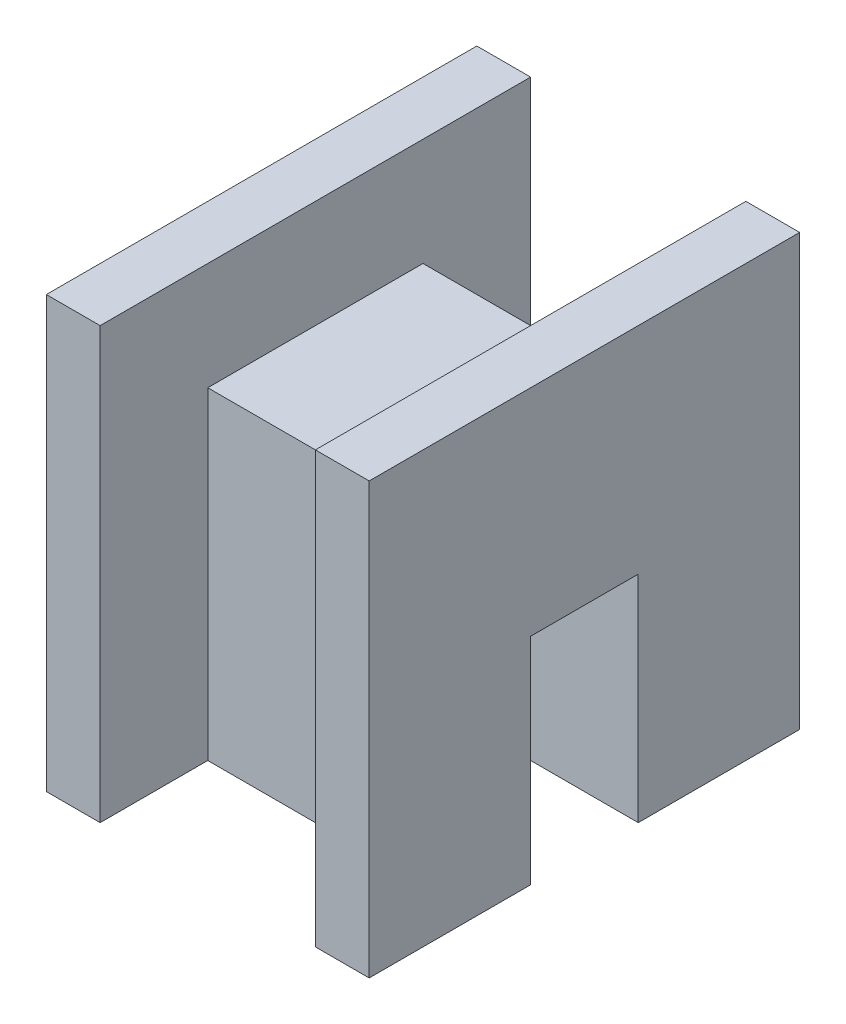
ISO-10303-21;
HEADER;
FILE_DESCRIPTION(('STEP AP214'),'2;1');
FILE_NAME('part.step','',(''),(''),'','','');
FILE_SCHEMA(('AUTOMOTIVE_DESIGN { 1 0 10303 214 1 1 1 1 }'));
ENDSEC;
DATA;
#1=APPLICATION_CONTEXT('core data for automotive mechanical design processes');
#2=APPLICATION_PROTOCOL_DEFINITION('international standard','automotive_design',2000,#1);
#3=PRODUCT_CONTEXT('',#1,'mechanical');
#4=PRODUCT('Part','Part','',(#3));
#5=PRODUCT_RELATED_PRODUCT_CATEGORY('part','',(#4));
#6=PRODUCT_DEFINITION_FORMATION('','',#4);
#7=PRODUCT_DEFINITION_CONTEXT('part definition',#1,'design');
#8=PRODUCT_DEFINITION('design','',#6,#7);
#9=PRODUCT_DEFINITION_SHAPE('','',#8);
#10=(LENGTH_UNIT() NAMED_UNIT(*) SI_UNIT(.MILLI.,.METRE.));
#11=(NAMED_UNIT(*) PLANE_ANGLE_UNIT() SI_UNIT($,.RADIAN.));
#12=(NAMED_UNIT(*) SI_UNIT($,.STERADIAN.) SOLID_ANGLE_UNIT());
#13=UNCERTAINTY_MEASURE_WITH_UNIT(LENGTH_MEASURE(1.E-05),#10,'distance_accuracy_value','');
#14=(GEOMETRIC_REPRESENTATION_CONTEXT(3) GLOBAL_UNCERTAINTY_ASSIGNED_CONTEXT((#13)) GLOBAL_UNIT_ASSIGNED_CONTEXT((#10,
#11,#12)) REPRESENTATION_CONTEXT('',''));
#15=CARTESIAN_POINT('',(0.,0.,0.));
#16=DIRECTION('',(0.,0.,1.));
#17=DIRECTION('',(1.,0.,0.));
#18=AXIS2_PLACEMENT_3D('',#15,#16,#17);
#19=CARTESIAN_POINT('',(15.,40.,-20.));
#20=DIRECTION('',(0.,0.,1.));
#21=DIRECTION('',(0.,-1.,0.));
#22=AXIS2_PLACEMENT_3D('',#19,#20,#21);
#23=PLANE('',#22);
#24=DIRECTION('',(0.,1.,0.));
#25=VECTOR('',#24,1.);
#26=CARTESIAN_POINT('',(10.,40.,-20.));
#27=LINE('',#26,#25);
#28=CARTESIAN_POINT('',(10.,0.,-20.));
#29=VERTEX_POINT('',#28);
#30=CARTESIAN_POINT('',(10.,40.,-20.));
#31=VERTEX_POINT('',#30);
#32=EDGE_CURVE('E140',#29,#31,#27,.T.);
#33=ORIENTED_EDGE('',*,*,#32,.T.);
#34=DIRECTION('',(-1.,0.,0.));
#35=VECTOR('',#34,1.);
#36=CARTESIAN_POINT('',(15.,40.,-20.));
#37=LINE('',#36,#35);
#38=CARTESIAN_POINT('',(15.,40.,-20.));
#39=VERTEX_POINT('',#38);
#40=EDGE_CURVE('E137',#39,#31,#37,.T.);
#41=ORIENTED_EDGE('',*,*,#40,.F.);
#42=DIRECTION('',(0.,1.,0.));
#43=VECTOR('',#42,1.);
#44=CARTESIAN_POINT('',(15.,40.,-20.));
#45=LINE('',#44,#43);
#46=CARTESIAN_POINT('',(15.,0.,-20.));
#47=VERTEX_POINT('',#46);
#48=EDGE_CURVE('E122',#47,#39,#45,.T.);
#49=ORIENTED_EDGE('',*,*,#48,.F.);
#50=DIRECTION('',(-1.,0.,0.));
#51=VECTOR('',#50,1.);
#52=CARTESIAN_POINT('',(15.,0.,-20.));
#53=LINE('',#52,#51);
#54=EDGE_CURVE('E192',#47,#29,#53,.T.);
#55=ORIENTED_EDGE('',*,*,#54,.T.);
#56=EDGE_LOOP('',(#33,#41,#49,#55));
#57=FACE_BOUND('',#56,.T.);
#58=ADVANCED_FACE('F39',(#57),#23,.F.);
#59=CARTESIAN_POINT('',(15.,40.,20.));
#60=DIRECTION('',(0.,-1.,0.));
#61=DIRECTION('',(0.,0.,-1.));
#62=AXIS2_PLACEMENT_3D('',#59,#60,#61);
#63=PLANE('',#62);
#64=DIRECTION('',(0.,0.,1.));
#65=VECTOR('',#64,1.);
#66=CARTESIAN_POINT('',(10.,40.,20.));
#67=LINE('',#66,#65);
#68=CARTESIAN_POINT('',(10.,40.,20.));
#69=VERTEX_POINT('',#68);
#70=EDGE_CURVE('E255',#31,#69,#67,.T.);
#71=ORIENTED_EDGE('',*,*,#70,.T.);
#72=DIRECTION('',(-1.,0.,0.));
#73=VECTOR('',#72,1.);
#74=CARTESIAN_POINT('',(15.,40.,20.));
#75=LINE('',#74,#73);
#76=CARTESIAN_POINT('',(15.,40.,20.));
#77=VERTEX_POINT('',#76);
#78=EDGE_CURVE('E149',#77,#69,#75,.T.);
#79=ORIENTED_EDGE('',*,*,#78,.F.);
#80=DIRECTION('',(0.,0.,1.));
#81=VECTOR('',#80,1.);
#82=CARTESIAN_POINT('',(15.,40.,20.));
#83=LINE('',#82,#81);
#84=EDGE_CURVE('E126',#39,#77,#83,.T.);
#85=ORIENTED_EDGE('',*,*,#84,.F.);
#86=ORIENTED_EDGE('',*,*,#40,.T.);
#87=EDGE_LOOP('',(#71,#79,#85,#86));
#88=FACE_BOUND('',#87,.T.);
#89=ADVANCED_FACE('F147',(#88),#63,.F.);
#90=CARTESIAN_POINT('',(15.,0.,20.));
#91=DIRECTION('',(0.,0.,-1.));
#92=DIRECTION('',(0.,1.,0.));
#93=AXIS2_PLACEMENT_3D('',#90,#91,#92);
#94=PLANE('',#93);
#95=DIRECTION('',(0.,-1.,0.));
#96=VECTOR('',#95,1.);
#97=CARTESIAN_POINT('',(10.,0.,20.));
#98=LINE('',#97,#96);
#99=CARTESIAN_POINT('',(10.,0.,20.));
#100=VERTEX_POINT('',#99);
#101=EDGE_CURVE('E251',#69,#100,#98,.T.);
#102=ORIENTED_EDGE('',*,*,#101,.T.);
#103=DIRECTION('',(-1.,0.,0.));
#104=VECTOR('',#103,1.);
#105=CARTESIAN_POINT('',(15.,0.,20.));
#106=LINE('',#105,#104);
#107=CARTESIAN_POINT('',(15.,0.,20.));
#108=VERTEX_POINT('',#107);
#109=EDGE_CURVE('E185',#108,#100,#106,.T.);
#110=ORIENTED_EDGE('',*,*,#109,.F.);
#111=DIRECTION('',(0.,-1.,0.));
#112=VECTOR('',#111,1.);
#113=CARTESIAN_POINT('',(15.,0.,20.));
#114=LINE('',#113,#112);
#115=EDGE_CURVE('E64',#77,#108,#114,.T.);
#116=ORIENTED_EDGE('',*,*,#115,.F.);
#117=ORIENTED_EDGE('',*,*,#78,.T.);
#118=EDGE_LOOP('',(#102,#110,#116,#117));
#119=FACE_BOUND('',#118,.T.);
#120=ADVANCED_FACE('F340',(#119),#94,.F.);
#121=CARTESIAN_POINT('',(15.,0.,5.));
#122=DIRECTION('',(0.,1.,0.));
#123=DIRECTION('',(0.,0.,1.));
#124=AXIS2_PLACEMENT_3D('',#121,#122,#123);
#125=PLANE('',#124);
#126=DIRECTION('',(1.,0.,0.));
#127=VECTOR('',#126,1.);
#128=CARTESIAN_POINT('',(-10.,0.,10.));
#129=LINE('',#128,#127);
#130=CARTESIAN_POINT('',(-10.,0.,10.));
#131=VERTEX_POINT('',#130);
#132=CARTESIAN_POINT('',(10.,0.,10.));
#133=VERTEX_POINT('',#132);
#134=EDGE_CURVE('E235',#131,#133,#129,.T.);
#135=ORIENTED_EDGE('',*,*,#134,.F.);
#136=DIRECTION('',(0.,0.,-1.));
#137=VECTOR('',#136,1.);
#138=CARTESIAN_POINT('',(-10.,0.,10.));
#139=LINE('',#138,#137);
#140=CARTESIAN_POINT('',(-10.,0.,20.));
#141=VERTEX_POINT('',#140);
#142=EDGE_CURVE('E254',#141,#131,#139,.T.);
#143=ORIENTED_EDGE('',*,*,#142,.F.);
#144=CARTESIAN_POINT('',(-15.,0.,20.));
#145=VERTEX_POINT('',#144);
#146=EDGE_CURVE('E98',#141,#145,#106,.T.);
#147=ORIENTED_EDGE('',*,*,#146,.T.);
#148=DIRECTION('',(0.,0.,-1.));
#149=VECTOR('',#148,1.);
#150=CARTESIAN_POINT('',(-15.,0.,5.));
#151=LINE('',#150,#149);
#152=CARTESIAN_POINT('',(-15.,0.,5.));
#153=VERTEX_POINT('',#152);
#154=EDGE_CURVE('E156',#145,#153,#151,.T.);
#155=ORIENTED_EDGE('',*,*,#154,.T.);
#156=DIRECTION('',(-1.,0.,0.));
#157=VECTOR('',#156,1.);
#158=CARTESIAN_POINT('',(15.,0.,5.));
#159=LINE('',#158,#157);
#160=CARTESIAN_POINT('',(15.,0.,5.));
#161=VERTEX_POINT('',#160);
#162=EDGE_CURVE('E11',#161,#153,#159,.T.);
#163=ORIENTED_EDGE('',*,*,#162,.F.);
#164=DIRECTION('',(0.,0.,-1.));
#165=VECTOR('',#164,1.);
#166=CARTESIAN_POINT('',(15.,0.,5.));
#167=LINE('',#166,#165);
#168=EDGE_CURVE('E184',#108,#161,#167,.T.);
#169=ORIENTED_EDGE('',*,*,#168,.F.);
#170=ORIENTED_EDGE('',*,*,#109,.T.);
#171=DIRECTION('',(0.,0.,-1.));
#172=VECTOR('',#171,1.);
#173=CARTESIAN_POINT('',(10.,0.,10.));
#174=LINE('',#173,#172);
#175=EDGE_CURVE('E55',#100,#133,#174,.T.);
#176=ORIENTED_EDGE('',*,*,#175,.T.);
#177=EDGE_LOOP('',(#135,#143,#147,#155,#163,#169,#170,#176));
#178=FACE_BOUND('',#177,.T.);
#179=ADVANCED_FACE('F41',(#178),#125,.F.);
#180=CARTESIAN_POINT('',(15.,20.,5.));
#181=DIRECTION('',(0.,0.,1.));
#182=DIRECTION('',(0.,-1.,0.));
#183=AXIS2_PLACEMENT_3D('',#180,#181,#182);
#184=PLANE('',#183);
#185=DIRECTION('',(0.,1.,0.));
#186=VECTOR('',#185,1.);
#187=CARTESIAN_POINT('',(-15.,20.,5.));
#188=LINE('',#187,#186);
#189=CARTESIAN_POINT('',(-15.,20.,5.));
#190=VERTEX_POINT('',#189);
#191=EDGE_CURVE('E159',#153,#190,#188,.T.);
#192=ORIENTED_EDGE('',*,*,#191,.T.);
#193=DIRECTION('',(-1.,0.,0.));
#194=VECTOR('',#193,1.);
#195=CARTESIAN_POINT('',(15.,20.,5.));
#196=LINE('',#195,#194);
#197=CARTESIAN_POINT('',(15.,20.,5.));
#198=VERTEX_POINT('',#197);
#199=EDGE_CURVE('E48',#198,#190,#196,.T.);
#200=ORIENTED_EDGE('',*,*,#199,.F.);
#201=DIRECTION('',(0.,1.,0.));
#202=VECTOR('',#201,1.);
#203=CARTESIAN_POINT('',(15.,20.,5.));
#204=LINE('',#203,#202);
#205=EDGE_CURVE('E106',#161,#198,#204,.T.);
#206=ORIENTED_EDGE('',*,*,#205,.F.);
#207=ORIENTED_EDGE('',*,*,#162,.T.);
#208=EDGE_LOOP('',(#192,#200,#206,#207));
#209=FACE_BOUND('',#208,.T.);
#210=ADVANCED_FACE('F343',(#209),#184,.F.);
#211=CARTESIAN_POINT('',(15.,20.,-5.));
#212=DIRECTION('',(0.,1.,0.));
#213=DIRECTION('',(0.,0.,1.));
#214=AXIS2_PLACEMENT_3D('',#211,#212,#213);
#215=PLANE('',#214);
#216=DIRECTION('',(0.,0.,-1.));
#217=VECTOR('',#216,1.);
#218=CARTESIAN_POINT('',(-15.,20.,-5.));
#219=LINE('',#218,#217);
#220=CARTESIAN_POINT('',(-15.,20.,-5.));
#221=VERTEX_POINT('',#220);
#222=EDGE_CURVE('E163',#190,#221,#219,.T.);
#223=ORIENTED_EDGE('',*,*,#222,.T.);
#224=DIRECTION('',(-1.,0.,0.));
#225=VECTOR('',#224,1.);
#226=CARTESIAN_POINT('',(15.,20.,-5.));
#227=LINE('',#226,#225);
#228=CARTESIAN_POINT('',(15.,20.,-5.));
#229=VERTEX_POINT('',#228);
#230=EDGE_CURVE('E199',#229,#221,#227,.T.);
#231=ORIENTED_EDGE('',*,*,#230,.F.);
#232=DIRECTION('',(0.,0.,-1.));
#233=VECTOR('',#232,1.);
#234=CARTESIAN_POINT('',(15.,20.,-5.));
#235=LINE('',#234,#233);
#236=EDGE_CURVE('E209',#198,#229,#235,.T.);
#237=ORIENTED_EDGE('',*,*,#236,.F.);
#238=ORIENTED_EDGE('',*,*,#199,.T.);
#239=EDGE_LOOP('',(#223,#231,#237,#238));
#240=FACE_BOUND('',#239,.T.);
#241=ADVANCED_FACE('F207',(#240),#215,.F.);
#242=CARTESIAN_POINT('',(15.,0.,-5.));
#243=DIRECTION('',(0.,0.,-1.));
#244=DIRECTION('',(0.,1.,0.));
#245=AXIS2_PLACEMENT_3D('',#242,#243,#244);
#246=PLANE('',#245);
#247=DIRECTION('',(0.,-1.,0.));
#248=VECTOR('',#247,1.);
#249=CARTESIAN_POINT('',(-15.,0.,-5.));
#250=LINE('',#249,#248);
#251=CARTESIAN_POINT('',(-15.,0.,-5.));
#252=VERTEX_POINT('',#251);
#253=EDGE_CURVE('E166',#221,#252,#250,.T.);
#254=ORIENTED_EDGE('',*,*,#253,.T.);
#255=DIRECTION('',(-1.,0.,0.));
#256=VECTOR('',#255,1.);
#257=CARTESIAN_POINT('',(15.,0.,-5.));
#258=LINE('',#257,#256);
#259=CARTESIAN_POINT('',(15.,0.,-5.));
#260=VERTEX_POINT('',#259);
#261=EDGE_CURVE('E195',#260,#252,#258,.T.);
#262=ORIENTED_EDGE('',*,*,#261,.F.);
#263=DIRECTION('',(0.,-1.,0.));
#264=VECTOR('',#263,1.);
#265=CARTESIAN_POINT('',(15.,0.,-5.));
#266=LINE('',#265,#264);
#267=EDGE_CURVE('E225',#229,#260,#266,.T.);
#268=ORIENTED_EDGE('',*,*,#267,.F.);
#269=ORIENTED_EDGE('',*,*,#230,.T.);
#270=EDGE_LOOP('',(#254,#262,#268,#269));
#271=FACE_BOUND('',#270,.T.);
#272=ADVANCED_FACE('F218',(#271),#246,.F.);
#273=CARTESIAN_POINT('',(15.,0.,-20.));
#274=DIRECTION('',(0.,1.,0.));
#275=DIRECTION('',(0.,0.,1.));
#276=AXIS2_PLACEMENT_3D('',#273,#274,#275);
#277=PLANE('',#276);
#278=CARTESIAN_POINT('',(-10.,0.,-20.));
#279=VERTEX_POINT('',#278);
#280=CARTESIAN_POINT('',(-15.,0.,-20.));
#281=VERTEX_POINT('',#280);
#282=EDGE_CURVE('E144',#279,#281,#53,.T.);
#283=ORIENTED_EDGE('',*,*,#282,.F.);
#284=DIRECTION('',(0.,0.,-1.));
#285=VECTOR('',#284,1.);
#286=CARTESIAN_POINT('',(-10.,0.,-20.));
#287=LINE('',#286,#285);
#288=CARTESIAN_POINT('',(-10.,0.,-10.));
#289=VERTEX_POINT('',#288);
#290=EDGE_CURVE('E288',#289,#279,#287,.T.);
#291=ORIENTED_EDGE('',*,*,#290,.F.);
#292=DIRECTION('',(1.,0.,0.));
#293=VECTOR('',#292,1.);
#294=CARTESIAN_POINT('',(-10.,0.,-10.));
#295=LINE('',#294,#293);
#296=CARTESIAN_POINT('',(10.,0.,-10.));
#297=VERTEX_POINT('',#296);
#298=EDGE_CURVE('E160',#289,#297,#295,.T.);
#299=ORIENTED_EDGE('',*,*,#298,.T.);
#300=DIRECTION('',(0.,0.,-1.));
#301=VECTOR('',#300,1.);
#302=CARTESIAN_POINT('',(10.,0.,-20.));
#303=LINE('',#302,#301);
#304=EDGE_CURVE('E260',#297,#29,#303,.T.);
#305=ORIENTED_EDGE('',*,*,#304,.T.);
#306=ORIENTED_EDGE('',*,*,#54,.F.);
#307=DIRECTION('',(0.,0.,-1.));
#308=VECTOR('',#307,1.);
#309=CARTESIAN_POINT('',(15.,0.,-20.));
#310=LINE('',#309,#308);
#311=EDGE_CURVE('E129',#260,#47,#310,.T.);
#312=ORIENTED_EDGE('',*,*,#311,.F.);
#313=ORIENTED_EDGE('',*,*,#261,.T.);
#314=DIRECTION('',(0.,0.,-1.));
#315=VECTOR('',#314,1.);
#316=CARTESIAN_POINT('',(-15.,0.,-20.));
#317=LINE('',#316,#315);
#318=EDGE_CURVE('E169',#252,#281,#317,.T.);
#319=ORIENTED_EDGE('',*,*,#318,.T.);
#320=EDGE_LOOP('',(#283,#291,#299,#305,#306,#312,#313,#319));
#321=FACE_BOUND('',#320,.T.);
#322=ADVANCED_FACE('F222',(#321),#277,.F.);
#323=CARTESIAN_POINT('',(-10.,40.,-20.));
#324=VERTEX_POINT('',#323);
#325=CARTESIAN_POINT('',(-15.,40.,-20.));
#326=VERTEX_POINT('',#325);
#327=EDGE_CURVE('E145',#324,#326,#37,.T.);
#328=ORIENTED_EDGE('',*,*,#327,.F.);
#329=DIRECTION('',(0.,1.,0.));
#330=VECTOR('',#329,1.);
#331=CARTESIAN_POINT('',(-10.,40.,-20.));
#332=LINE('',#331,#330);
#333=EDGE_CURVE('E284',#279,#324,#332,.T.);
#334=ORIENTED_EDGE('',*,*,#333,.F.);
#335=ORIENTED_EDGE('',*,*,#282,.T.);
#336=DIRECTION('',(0.,1.,0.));
#337=VECTOR('',#336,1.);
#338=CARTESIAN_POINT('',(-15.,40.,-20.));
#339=LINE('',#338,#337);
#340=EDGE_CURVE('E173',#281,#326,#339,.T.);
#341=ORIENTED_EDGE('',*,*,#340,.T.);
#342=EDGE_LOOP('',(#328,#334,#335,#341));
#343=FACE_BOUND('',#342,.T.);
#344=ADVANCED_FACE('F352',(#343),#23,.F.);
#345=CARTESIAN_POINT('',(-10.,40.,20.));
#346=VERTEX_POINT('',#345);
#347=CARTESIAN_POINT('',(-15.,40.,20.));
#348=VERTEX_POINT('',#347);
#349=EDGE_CURVE('E189',#346,#348,#75,.T.);
#350=ORIENTED_EDGE('',*,*,#349,.F.);
#351=DIRECTION('',(0.,0.,1.));
#352=VECTOR('',#351,1.);
#353=CARTESIAN_POINT('',(-10.,40.,20.));
#354=LINE('',#353,#352);
#355=EDGE_CURVE('E280',#324,#346,#354,.T.);
#356=ORIENTED_EDGE('',*,*,#355,.F.);
#357=ORIENTED_EDGE('',*,*,#327,.T.);
#358=DIRECTION('',(0.,0.,1.));
#359=VECTOR('',#358,1.);
#360=CARTESIAN_POINT('',(-15.,40.,20.));
#361=LINE('',#360,#359);
#362=EDGE_CURVE('E177',#326,#348,#361,.T.);
#363=ORIENTED_EDGE('',*,*,#362,.T.);
#364=EDGE_LOOP('',(#350,#356,#357,#363));
#365=FACE_BOUND('',#364,.T.);
#366=ADVANCED_FACE('F357',(#365),#63,.F.);
#367=ORIENTED_EDGE('',*,*,#146,.F.);
#368=DIRECTION('',(0.,-1.,0.));
#369=VECTOR('',#368,1.);
#370=CARTESIAN_POINT('',(-10.,0.,20.));
#371=LINE('',#370,#369);
#372=EDGE_CURVE('E240',#346,#141,#371,.T.);
#373=ORIENTED_EDGE('',*,*,#372,.F.);
#374=ORIENTED_EDGE('',*,*,#349,.T.);
#375=DIRECTION('',(0.,-1.,0.));
#376=VECTOR('',#375,1.);
#377=CARTESIAN_POINT('',(-15.,0.,20.));
#378=LINE('',#377,#376);
#379=EDGE_CURVE('E181',#348,#145,#378,.T.);
#380=ORIENTED_EDGE('',*,*,#379,.T.);
#381=EDGE_LOOP('',(#367,#373,#374,#380));
#382=FACE_BOUND('',#381,.T.);
#383=ADVANCED_FACE('F365',(#382),#94,.F.);
#384=CARTESIAN_POINT('',(15.,0.,0.));
#385=DIRECTION('',(-1.,0.,0.));
#386=DIRECTION('',(0.,0.,1.));
#387=AXIS2_PLACEMENT_3D('',#384,#385,#386);
#388=PLANE('',#387);
#389=ORIENTED_EDGE('',*,*,#168,.T.);
#390=ORIENTED_EDGE('',*,*,#205,.T.);
#391=ORIENTED_EDGE('',*,*,#236,.T.);
#392=ORIENTED_EDGE('',*,*,#267,.T.);
#393=ORIENTED_EDGE('',*,*,#311,.T.);
#394=ORIENTED_EDGE('',*,*,#48,.T.);
#395=ORIENTED_EDGE('',*,*,#84,.T.);
#396=ORIENTED_EDGE('',*,*,#115,.T.);
#397=EDGE_LOOP('',(#389,#390,#391,#392,#393,#394,#395,#396));
#398=FACE_BOUND('',#397,.T.);
#399=ADVANCED_FACE('F124',(#398),#388,.F.);
#400=CARTESIAN_POINT('',(-15.,0.,0.));
#401=DIRECTION('',(-1.,0.,0.));
#402=DIRECTION('',(0.,0.,1.));
#403=AXIS2_PLACEMENT_3D('',#400,#401,#402);
#404=PLANE('',#403);
#405=ORIENTED_EDGE('',*,*,#154,.F.);
#406=ORIENTED_EDGE('',*,*,#379,.F.);
#407=ORIENTED_EDGE('',*,*,#362,.F.);
#408=ORIENTED_EDGE('',*,*,#340,.F.);
#409=ORIENTED_EDGE('',*,*,#318,.F.);
#410=ORIENTED_EDGE('',*,*,#253,.F.);
#411=ORIENTED_EDGE('',*,*,#222,.F.);
#412=ORIENTED_EDGE('',*,*,#191,.F.);
#413=EDGE_LOOP('',(#405,#406,#407,#408,#409,#410,#411,#412));
#414=FACE_BOUND('',#413,.T.);
#415=ADVANCED_FACE('F213',(#414),#404,.T.);
#416=CARTESIAN_POINT('',(-10.,30.,-10.));
#417=DIRECTION('',(0.,0.,1.));
#418=DIRECTION('',(1.,0.,0.));
#419=AXIS2_PLACEMENT_3D('',#416,#417,#418);
#420=PLANE('',#419);
#421=DIRECTION('',(0.,-1.,0.));
#422=VECTOR('',#421,1.);
#423=CARTESIAN_POINT('',(10.,30.,-10.));
#424=LINE('',#423,#422);
#425=CARTESIAN_POINT('',(10.,30.,-10.));
#426=VERTEX_POINT('',#425);
#427=EDGE_CURVE('E263',#426,#297,#424,.T.);
#428=ORIENTED_EDGE('',*,*,#427,.T.);
#429=ORIENTED_EDGE('',*,*,#298,.F.);
#430=DIRECTION('',(0.,-1.,0.));
#431=VECTOR('',#430,1.);
#432=CARTESIAN_POINT('',(-10.,30.,-10.));
#433=LINE('',#432,#431);
#434=CARTESIAN_POINT('',(-10.,30.,-10.));
#435=VERTEX_POINT('',#434);
#436=EDGE_CURVE('E292',#435,#289,#433,.T.);
#437=ORIENTED_EDGE('',*,*,#436,.F.);
#438=DIRECTION('',(1.,0.,0.));
#439=VECTOR('',#438,1.);
#440=CARTESIAN_POINT('',(-10.,30.,-10.));
#441=LINE('',#440,#439);
#442=EDGE_CURVE('E244',#435,#426,#441,.T.);
#443=ORIENTED_EDGE('',*,*,#442,.T.);
#444=EDGE_LOOP('',(#428,#429,#437,#443));
#445=FACE_BOUND('',#444,.T.);
#446=ADVANCED_FACE('F391',(#445),#420,.F.);
#447=CARTESIAN_POINT('',(-10.,30.,10.));
#448=DIRECTION('',(0.,-1.,0.));
#449=DIRECTION('',(0.,0.,-1.));
#450=AXIS2_PLACEMENT_3D('',#447,#448,#449);
#451=PLANE('',#450);
#452=DIRECTION('',(0.,0.,-1.));
#453=VECTOR('',#452,1.);
#454=CARTESIAN_POINT('',(10.,30.,10.));
#455=LINE('',#454,#453);
#456=CARTESIAN_POINT('',(10.,30.,10.));
#457=VERTEX_POINT('',#456);
#458=EDGE_CURVE('E267',#457,#426,#455,.T.);
#459=ORIENTED_EDGE('',*,*,#458,.T.);
#460=ORIENTED_EDGE('',*,*,#442,.F.);
#461=DIRECTION('',(0.,0.,-1.));
#462=VECTOR('',#461,1.);
#463=CARTESIAN_POINT('',(-10.,30.,10.));
#464=LINE('',#463,#462);
#465=CARTESIAN_POINT('',(-10.,30.,10.));
#466=VERTEX_POINT('',#465);
#467=EDGE_CURVE('E296',#466,#435,#464,.T.);
#468=ORIENTED_EDGE('',*,*,#467,.F.);
#469=DIRECTION('',(1.,0.,0.));
#470=VECTOR('',#469,1.);
#471=CARTESIAN_POINT('',(-10.,30.,10.));
#472=LINE('',#471,#470);
#473=EDGE_CURVE('E239',#466,#457,#472,.T.);
#474=ORIENTED_EDGE('',*,*,#473,.T.);
#475=EDGE_LOOP('',(#459,#460,#468,#474));
#476=FACE_BOUND('',#475,.T.);
#477=ADVANCED_FACE('F328',(#476),#451,.F.);
#478=CARTESIAN_POINT('',(-10.,0.,10.));
#479=DIRECTION('',(0.,0.,-1.));
#480=DIRECTION('',(-1.,0.,0.));
#481=AXIS2_PLACEMENT_3D('',#478,#479,#480);
#482=PLANE('',#481);
#483=DIRECTION('',(0.,1.,0.));
#484=VECTOR('',#483,1.);
#485=CARTESIAN_POINT('',(10.,0.,10.));
#486=LINE('',#485,#484);
#487=EDGE_CURVE('E271',#133,#457,#486,.T.);
#488=ORIENTED_EDGE('',*,*,#487,.T.);
#489=ORIENTED_EDGE('',*,*,#473,.F.);
#490=DIRECTION('',(0.,1.,0.));
#491=VECTOR('',#490,1.);
#492=CARTESIAN_POINT('',(-10.,0.,10.));
#493=LINE('',#492,#491);
#494=EDGE_CURVE('E300',#131,#466,#493,.T.);
#495=ORIENTED_EDGE('',*,*,#494,.F.);
#496=ORIENTED_EDGE('',*,*,#134,.T.);
#497=EDGE_LOOP('',(#488,#489,#495,#496));
#498=FACE_BOUND('',#497,.T.);
#499=ADVANCED_FACE('F316',(#498),#482,.F.);
#500=CARTESIAN_POINT('',(-10.,0.,0.));
#501=DIRECTION('',(-1.,0.,0.));
#502=DIRECTION('',(0.,0.,1.));
#503=AXIS2_PLACEMENT_3D('',#500,#501,#502);
#504=PLANE('',#503);
#505=ORIENTED_EDGE('',*,*,#142,.T.);
#506=ORIENTED_EDGE('',*,*,#494,.T.);
#507=ORIENTED_EDGE('',*,*,#467,.T.);
#508=ORIENTED_EDGE('',*,*,#436,.T.);
#509=ORIENTED_EDGE('',*,*,#290,.T.);
#510=ORIENTED_EDGE('',*,*,#333,.T.);
#511=ORIENTED_EDGE('',*,*,#355,.T.);
#512=ORIENTED_EDGE('',*,*,#372,.T.);
#513=EDGE_LOOP('',(#505,#506,#507,#508,#509,#510,#511,#512));
#514=FACE_BOUND('',#513,.T.);
#515=ADVANCED_FACE('F309',(#514),#504,.F.);
#516=CARTESIAN_POINT('',(10.,0.,0.));
#517=DIRECTION('',(-1.,0.,0.));
#518=DIRECTION('',(0.,0.,1.));
#519=AXIS2_PLACEMENT_3D('',#516,#517,#518);
#520=PLANE('',#519);
#521=ORIENTED_EDGE('',*,*,#175,.F.);
#522=ORIENTED_EDGE('',*,*,#101,.F.);
#523=ORIENTED_EDGE('',*,*,#70,.F.);
#524=ORIENTED_EDGE('',*,*,#32,.F.);
#525=ORIENTED_EDGE('',*,*,#304,.F.);
#526=ORIENTED_EDGE('',*,*,#427,.F.);
#527=ORIENTED_EDGE('',*,*,#458,.F.);
#528=ORIENTED_EDGE('',*,*,#487,.F.);
#529=EDGE_LOOP('',(#521,#522,#523,#524,#525,#526,#527,#528));
#530=FACE_BOUND('',#529,.T.);
#531=ADVANCED_FACE('F321',(#530),#520,.T.);
#532=CLOSED_SHELL('',(#58,#89,#120,#179,#210,#241,#272,#322,#344,#366,#383,#399,#415,#446,#477,
#499,#515,#531));
#533=MANIFOLD_SOLID_BREP('B2',#532);
#534=ADVANCED_BREP_SHAPE_REPRESENTATION('',(#18,#533),#14);
#535=SHAPE_DEFINITION_REPRESENTATION(#9,#534);
ENDSEC;
END-ISO-10303-21;
